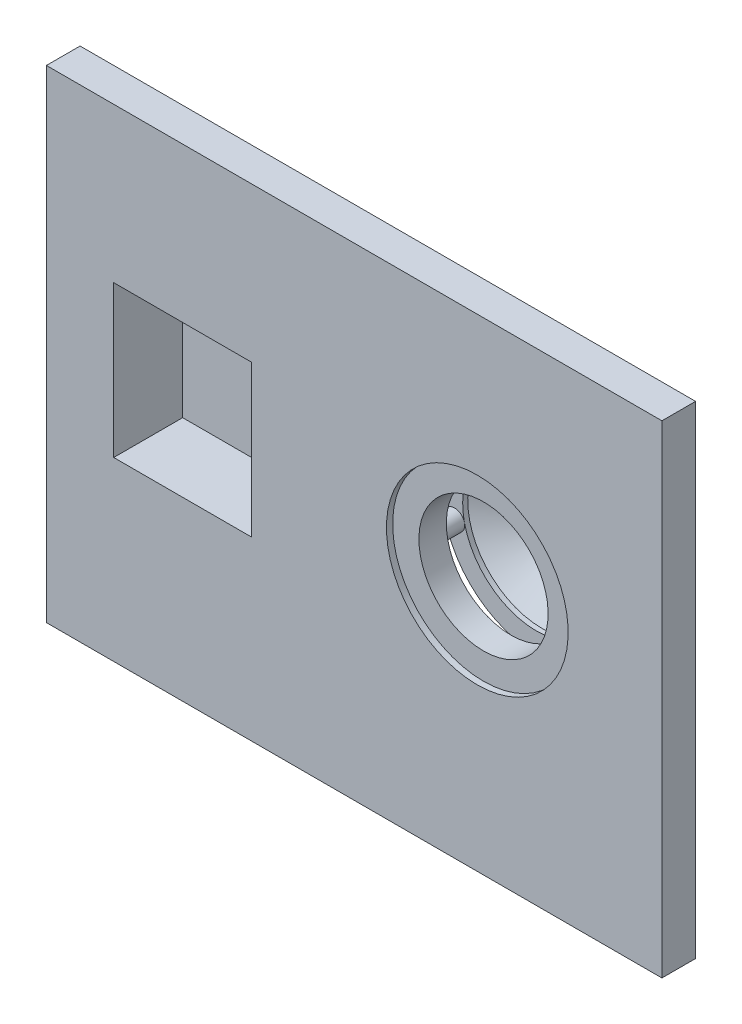
ISO-10303-21;
HEADER;
FILE_DESCRIPTION(('STEP AP214'),'2;1');
FILE_NAME('part.step','',(''),(''),'','','');
FILE_SCHEMA(('AUTOMOTIVE_DESIGN { 1 0 10303 214 1 1 1 1 }'));
ENDSEC;
DATA;
#1=APPLICATION_CONTEXT('core data for automotive mechanical design processes');
#2=APPLICATION_PROTOCOL_DEFINITION('international standard','automotive_design',2000,#1);
#3=PRODUCT_CONTEXT('',#1,'mechanical');
#4=PRODUCT('Part','Part','',(#3));
#5=PRODUCT_RELATED_PRODUCT_CATEGORY('part','',(#4));
#6=PRODUCT_DEFINITION_FORMATION('','',#4);
#7=PRODUCT_DEFINITION_CONTEXT('part definition',#1,'design');
#8=PRODUCT_DEFINITION('design','',#6,#7);
#9=PRODUCT_DEFINITION_SHAPE('','',#8);
#10=(LENGTH_UNIT() NAMED_UNIT(*) SI_UNIT(.MILLI.,.METRE.));
#11=(NAMED_UNIT(*) PLANE_ANGLE_UNIT() SI_UNIT($,.RADIAN.));
#12=(NAMED_UNIT(*) SI_UNIT($,.STERADIAN.) SOLID_ANGLE_UNIT());
#13=UNCERTAINTY_MEASURE_WITH_UNIT(LENGTH_MEASURE(1.E-05),#10,'distance_accuracy_value','');
#14=(GEOMETRIC_REPRESENTATION_CONTEXT(3) GLOBAL_UNCERTAINTY_ASSIGNED_CONTEXT((#13)) GLOBAL_UNIT_ASSIGNED_CONTEXT((#10,
#11,#12)) REPRESENTATION_CONTEXT('',''));
#15=CARTESIAN_POINT('',(0.,0.,0.));
#16=DIRECTION('',(0.,0.,1.));
#17=DIRECTION('',(1.,0.,0.));
#18=AXIS2_PLACEMENT_3D('',#15,#16,#17);
#19=CARTESIAN_POINT('',(17.1944269729057,-5.48634189692662,-9.99999999999988));
#20=DIRECTION('',(0.,0.,-1.));
#21=DIRECTION('',(-0.219453675877068,0.975622921083778,0.));
#22=AXIS2_PLACEMENT_3D('',#19,#20,#21);
#23=CYLINDRICAL_SURFACE('',#22,3.);
#24=CARTESIAN_POINT('',(17.1944269729056,-5.48634189692665,-17.6550000000001));
#25=DIRECTION('',(0.,0.,1.));
#26=DIRECTION('',(-0.975622921083778,-0.219453675877068,0.));
#27=AXIS2_PLACEMENT_3D('',#24,#25,#26);
#28=CIRCLE('',#27,3.);
#29=CARTESIAN_POINT('',(14.2675582096543,-6.14470292455785,-17.655));
#30=VERTEX_POINT('',#29);
#31=CARTESIAN_POINT('',(20.121295736157,-4.82798086929544,-17.6550000000001));
#32=VERTEX_POINT('',#31);
#33=EDGE_CURVE('E666',#30,#32,#28,.F.);
#34=ORIENTED_EDGE('',*,*,#33,.F.);
#35=EDGE_CURVE('E630',#32,#30,#28,.F.);
#36=ORIENTED_EDGE('',*,*,#35,.F.);
#37=EDGE_LOOP('',(#34,#36));
#38=FACE_BOUND('',#37,.T.);
#39=CARTESIAN_POINT('',(17.1944269729057,-5.48634189692662,-9.99999999999988));
#40=DIRECTION('',(0.,0.,1.));
#41=DIRECTION('',(0.219453675877068,-0.975622921083778,0.));
#42=AXIS2_PLACEMENT_3D('',#39,#40,#41);
#43=CIRCLE('',#42,3.);
#44=CARTESIAN_POINT('',(17.8527880005369,-8.41321066017795,-9.99999999999988));
#45=VERTEX_POINT('',#44);
#46=EDGE_CURVE('E668',#45,#45,#43,.T.);
#47=ORIENTED_EDGE('',*,*,#46,.F.);
#48=EDGE_LOOP('',(#47));
#49=FACE_BOUND('',#48,.T.);
#50=ADVANCED_FACE('F39',(#38,#49),#23,.T.);
#51=CARTESIAN_POINT('',(22.0883316375154,15.648639645774,-9.99999999999994));
#52=DIRECTION('',(0.,0.,-1.));
#53=DIRECTION('',(0.625945585830957,0.779866734499389,0.));
#54=AXIS2_PLACEMENT_3D('',#51,#52,#53);
#55=CYLINDRICAL_SURFACE('',#54,3.);
#56=CARTESIAN_POINT('',(22.0883316375154,15.648639645774,-17.6550000000001));
#57=DIRECTION('',(0.,0.,1.));
#58=DIRECTION('',(-0.779866734499389,0.625945585830957,0.));
#59=AXIS2_PLACEMENT_3D('',#56,#57,#58);
#60=CIRCLE('',#59,3.);
#61=CARTESIAN_POINT('',(19.7487314340172,17.5264764032668,-17.6550000000001));
#62=VERTEX_POINT('',#61);
#63=CARTESIAN_POINT('',(24.4279318410135,13.7708028882811,-17.6550000000001));
#64=VERTEX_POINT('',#63);
#65=EDGE_CURVE('E674',#62,#64,#60,.F.);
#66=ORIENTED_EDGE('',*,*,#65,.F.);
#67=EDGE_CURVE('E677',#64,#62,#60,.F.);
#68=ORIENTED_EDGE('',*,*,#67,.F.);
#69=EDGE_LOOP('',(#66,#68));
#70=FACE_BOUND('',#69,.T.);
#71=CARTESIAN_POINT('',(22.0883316375154,15.648639645774,-9.99999999999994));
#72=DIRECTION('',(0.,0.,1.));
#73=DIRECTION('',(-0.625945585830957,-0.779866734499389,0.));
#74=AXIS2_PLACEMENT_3D('',#71,#72,#73);
#75=CIRCLE('',#74,3.);
#76=CARTESIAN_POINT('',(20.2104948800225,13.3090394422758,-9.99999999999993));
#77=VERTEX_POINT('',#76);
#78=EDGE_CURVE('E671',#77,#77,#75,.T.);
#79=ORIENTED_EDGE('',*,*,#78,.F.);
#80=EDGE_LOOP('',(#79));
#81=FACE_BOUND('',#80,.T.);
#82=ADVANCED_FACE('F493',(#70,#81),#55,.T.);
#83=CARTESIAN_POINT('',(63.0487042638432,4.82798086929556,-17.6550000000002));
#84=DIRECTION('',(0.,0.,1.));
#85=DIRECTION('',(-0.975622921083778,-0.219453675877068,0.));
#86=AXIS2_PLACEMENT_3D('',#83,#84,#85);
#87=PLANE('',#86);
#88=CARTESIAN_POINT('',(41.5850000000001,0.,-17.6550000000001));
#89=DIRECTION('',(0.,0.,-1.));
#90=DIRECTION('',(0.975622921083778,0.219453675877068,0.));
#91=AXIS2_PLACEMENT_3D('',#88,#89,#90);
#92=CIRCLE('',#91,22.);
#93=EDGE_CURVE('E11',#32,#64,#92,.T.);
#94=ORIENTED_EDGE('',*,*,#93,.T.);
#95=ORIENTED_EDGE('',*,*,#67,.T.);
#96=CARTESIAN_POINT('',(41.5850000000001,0.,-17.6550000000001));
#97=DIRECTION('',(0.,0.,-1.));
#98=DIRECTION('',(0.975622921083778,0.219453675877068,0.));
#99=AXIS2_PLACEMENT_3D('',#96,#97,#98);
#100=CIRCLE('',#99,28.);
#101=EDGE_CURVE('E640',#30,#62,#100,.T.);
#102=ORIENTED_EDGE('',*,*,#101,.F.);
#103=ORIENTED_EDGE('',*,*,#33,.T.);
#104=EDGE_LOOP('',(#94,#95,#102,#103));
#105=FACE_BOUND('',#104,.T.);
#106=ADVANCED_FACE('F254',(#105),#87,.T.);
#107=CARTESIAN_POINT('',(41.6636252386325,24.9998763611313,-10.));
#108=DIRECTION('',(0.,0.,-1.));
#109=DIRECTION('',(0.999995054445251,-0.00314500954529701,0.));
#110=AXIS2_PLACEMENT_3D('',#107,#108,#109);
#111=CYLINDRICAL_SURFACE('',#110,3.);
#112=CARTESIAN_POINT('',(41.6636252386325,24.9998763611313,-17.6550000000002));
#113=DIRECTION('',(0.,0.,1.));
#114=DIRECTION('',(0.00314500954529701,0.999995054445251,0.));
#115=AXIS2_PLACEMENT_3D('',#112,#113,#114);
#116=CIRCLE('',#115,3.);
#117=CARTESIAN_POINT('',(41.6730602672684,27.9998615244671,-17.6550000000002));
#118=VERTEX_POINT('',#117);
#119=CARTESIAN_POINT('',(41.6541902099966,21.9998911977956,-17.6550000000002));
#120=VERTEX_POINT('',#119);
#121=EDGE_CURVE('E681',#118,#120,#116,.F.);
#122=ORIENTED_EDGE('',*,*,#121,.F.);
#123=EDGE_CURVE('E684',#120,#118,#116,.F.);
#124=ORIENTED_EDGE('',*,*,#123,.F.);
#125=EDGE_LOOP('',(#122,#124));
#126=FACE_BOUND('',#125,.T.);
#127=CARTESIAN_POINT('',(41.6636252386325,24.9998763611313,-10.));
#128=DIRECTION('',(0.,0.,1.));
#129=DIRECTION('',(-0.999995054445251,0.00314500954529701,0.));
#130=AXIS2_PLACEMENT_3D('',#127,#128,#129);
#131=CIRCLE('',#130,3.);
#132=CARTESIAN_POINT('',(38.6636400752968,25.0093113897672,-10.));
#133=VERTEX_POINT('',#132);
#134=EDGE_CURVE('E678',#133,#133,#131,.T.);
#135=ORIENTED_EDGE('',*,*,#134,.F.);
#136=EDGE_LOOP('',(#135));
#137=FACE_BOUND('',#136,.T.);
#138=ADVANCED_FACE('F524',(#126,#137),#111,.T.);
#139=EDGE_CURVE('E49',#64,#120,#92,.T.);
#140=ORIENTED_EDGE('',*,*,#139,.T.);
#141=ORIENTED_EDGE('',*,*,#123,.T.);
#142=EDGE_CURVE('E647',#62,#118,#100,.T.);
#143=ORIENTED_EDGE('',*,*,#142,.F.);
#144=ORIENTED_EDGE('',*,*,#65,.T.);
#145=EDGE_LOOP('',(#140,#141,#143,#144));
#146=FACE_BOUND('',#145,.T.);
#147=ADVANCED_FACE('F512',(#146),#87,.T.);
#148=CARTESIAN_POINT('',(61.1797124313969,15.5256962720152,-10.));
#149=DIRECTION('',(0.,0.,-1.));
#150=DIRECTION('',(0.621027850880606,-0.783788497255871,0.));
#151=AXIS2_PLACEMENT_3D('',#148,#149,#150);
#152=CYLINDRICAL_SURFACE('',#151,3.);
#153=CARTESIAN_POINT('',(61.1797124313969,15.5256962720152,-17.6550000000002));
#154=DIRECTION('',(0.,0.,1.));
#155=DIRECTION('',(0.783788497255871,0.621027850880606,0.));
#156=AXIS2_PLACEMENT_3D('',#153,#154,#155);
#157=CIRCLE('',#156,3.);
#158=CARTESIAN_POINT('',(63.5310779231645,17.388779824657,-17.6550000000002));
#159=VERTEX_POINT('',#158);
#160=CARTESIAN_POINT('',(58.8283469396292,13.6626127193734,-17.6550000000002));
#161=VERTEX_POINT('',#160);
#162=EDGE_CURVE('E688',#159,#161,#157,.F.);
#163=ORIENTED_EDGE('',*,*,#162,.F.);
#164=EDGE_CURVE('E690',#161,#159,#157,.F.);
#165=ORIENTED_EDGE('',*,*,#164,.F.);
#166=EDGE_LOOP('',(#163,#165));
#167=FACE_BOUND('',#166,.T.);
#168=CARTESIAN_POINT('',(61.1797124313969,15.5256962720152,-10.));
#169=DIRECTION('',(0.,0.,1.));
#170=DIRECTION('',(-0.621027850880606,0.783788497255871,0.));
#171=AXIS2_PLACEMENT_3D('',#168,#169,#170);
#172=CIRCLE('',#171,3.);
#173=CARTESIAN_POINT('',(59.316628878755,17.8770617637828,-10.));
#174=VERTEX_POINT('',#173);
#175=EDGE_CURVE('E685',#174,#174,#172,.T.);
#176=ORIENTED_EDGE('',*,*,#175,.F.);
#177=EDGE_LOOP('',(#176));
#178=FACE_BOUND('',#177,.T.);
#179=ADVANCED_FACE('F552',(#167,#178),#152,.T.);
#180=EDGE_CURVE('E699',#120,#161,#92,.T.);
#181=ORIENTED_EDGE('',*,*,#180,.T.);
#182=ORIENTED_EDGE('',*,*,#164,.T.);
#183=EDGE_CURVE('E645',#118,#159,#100,.T.);
#184=ORIENTED_EDGE('',*,*,#183,.F.);
#185=ORIENTED_EDGE('',*,*,#121,.T.);
#186=EDGE_LOOP('',(#181,#182,#184,#185));
#187=FACE_BOUND('',#186,.T.);
#188=ADVANCED_FACE('F540',(#187),#87,.T.);
#189=CARTESIAN_POINT('',(65.9405815040285,-5.63964977641604,-10.));
#190=DIRECTION('',(0.,0.,-1.));
#191=DIRECTION('',(-0.225585991056645,-0.974223260161135,0.));
#192=AXIS2_PLACEMENT_3D('',#189,#190,#191);
#193=CYLINDRICAL_SURFACE('',#192,3.);
#194=CARTESIAN_POINT('',(65.9405815040285,-5.63964977641606,-17.6550000000002));
#195=DIRECTION('',(0.,0.,1.));
#196=DIRECTION('',(0.974223260161135,-0.225585991056645,0.));
#197=AXIS2_PLACEMENT_3D('',#194,#195,#196);
#198=CIRCLE('',#197,3.);
#199=CARTESIAN_POINT('',(68.8632512845119,-6.316407749586,-17.6550000000002));
#200=VERTEX_POINT('',#199);
#201=CARTESIAN_POINT('',(63.0179117235451,-4.96289180324613,-17.6550000000002));
#202=VERTEX_POINT('',#201);
#203=EDGE_CURVE('E626',#200,#202,#198,.F.);
#204=ORIENTED_EDGE('',*,*,#203,.F.);
#205=EDGE_CURVE('E58',#202,#200,#198,.F.);
#206=ORIENTED_EDGE('',*,*,#205,.F.);
#207=EDGE_LOOP('',(#204,#206));
#208=FACE_BOUND('',#207,.T.);
#209=CARTESIAN_POINT('',(65.9405815040285,-5.63964977641604,-10.));
#210=DIRECTION('',(0.,0.,1.));
#211=DIRECTION('',(0.225585991056645,0.974223260161135,0.));
#212=AXIS2_PLACEMENT_3D('',#209,#210,#211);
#213=CIRCLE('',#212,3.);
#214=CARTESIAN_POINT('',(66.6173394771984,-2.71697999593264,-10.));
#215=VERTEX_POINT('',#214);
#216=EDGE_CURVE('E691',#215,#215,#213,.T.);
#217=ORIENTED_EDGE('',*,*,#216,.F.);
#218=EDGE_LOOP('',(#217));
#219=FACE_BOUND('',#218,.T.);
#220=ADVANCED_FACE('F327',(#208,#219),#193,.T.);
#221=EDGE_CURVE('E696',#161,#202,#92,.T.);
#222=ORIENTED_EDGE('',*,*,#221,.T.);
#223=ORIENTED_EDGE('',*,*,#205,.T.);
#224=EDGE_CURVE('E637',#159,#200,#100,.T.);
#225=ORIENTED_EDGE('',*,*,#224,.F.);
#226=ORIENTED_EDGE('',*,*,#162,.T.);
#227=EDGE_LOOP('',(#222,#223,#225,#226));
#228=FACE_BOUND('',#227,.T.);
#229=ADVANCED_FACE('F526',(#228),#87,.T.);
#230=EDGE_CURVE('E623',#200,#30,#100,.T.);
#231=ORIENTED_EDGE('',*,*,#230,.F.);
#232=ORIENTED_EDGE('',*,*,#203,.T.);
#233=EDGE_CURVE('E51',#202,#32,#92,.T.);
#234=ORIENTED_EDGE('',*,*,#233,.T.);
#235=ORIENTED_EDGE('',*,*,#35,.T.);
#236=EDGE_LOOP('',(#231,#232,#234,#235));
#237=FACE_BOUND('',#236,.T.);
#238=ADVANCED_FACE('F248',(#237),#87,.T.);
#239=CARTESIAN_POINT('',(41.5850000000001,0.,-19.1550000000002));
#240=DIRECTION('',(0.,0.,1.));
#241=DIRECTION('',(-0.975622921083778,-0.219453675877068,0.));
#242=AXIS2_PLACEMENT_3D('',#239,#240,#241);
#243=CONICAL_SURFACE('',#242,22.,1.0372252204965);
#244=CARTESIAN_POINT('',(41.585,0.,-31.1550000000001));
#245=DIRECTION('',(0.,0.,-1.));
#246=DIRECTION('',(0.975622921083778,0.219453675877068,0.));
#247=AXIS2_PLACEMENT_3D('',#244,#245,#246);
#248=CIRCLE('',#247,1.68594999999996);
#249=CARTESIAN_POINT('',(39.9401485361989,-0.369987924844903,-31.1550000000001));
#250=VERTEX_POINT('',#249);
#251=EDGE_CURVE('E661',#250,#250,#248,.T.);
#252=CARTESIAN_POINT('',(41.5850000000001,0.,-19.1550000000002));
#253=DIRECTION('',(0.,0.,-1.));
#254=DIRECTION('',(0.975622921083778,0.219453675877068,0.));
#255=AXIS2_PLACEMENT_3D('',#252,#253,#254);
#256=CIRCLE('',#255,22.);
#257=CARTESIAN_POINT('',(20.121295736157,-4.82798086929544,-19.1550000000001));
#258=VERTEX_POINT('',#257);
#259=EDGE_CURVE('E664',#258,#258,#256,.T.);
#260=CARTESIAN_POINT('',(39.9401485361989,-0.369987924844903,-31.1550000000001));
#261=CARTESIAN_POINT('',(39.7337021528651,-0.416425351349596,-31.0300000000001));
#262=CARTESIAN_POINT('',(39.5272557695313,-0.462862777854289,-30.9050000000001));
#263=CARTESIAN_POINT('',(39.1143630028638,-0.555737630863676,-30.6550000000001));
#264=CARTESIAN_POINT('',(38.90791661953,-0.602175057368369,-30.5300000000001));
#265=CARTESIAN_POINT('',(38.4950238528625,-0.695049910377755,-30.2800000000001));
#266=CARTESIAN_POINT('',(38.2885774695287,-0.741487336882448,-30.1550000000001));
#267=CARTESIAN_POINT('',(37.8756847028612,-0.834362189891834,-29.9050000000001));
#268=CARTESIAN_POINT('',(37.6692383195274,-0.880799616396528,-29.7800000000001));
#269=CARTESIAN_POINT('',(37.2563455528599,-0.973674469405914,-29.5300000000001));
#270=CARTESIAN_POINT('',(37.0498991695261,-1.02011189591061,-29.4050000000001));
#271=CARTESIAN_POINT('',(36.6370064028586,-1.11298674891999,-29.1550000000001));
#272=CARTESIAN_POINT('',(36.4305600195248,-1.15942417542469,-29.0300000000001));
#273=CARTESIAN_POINT('',(36.0176672528573,-1.25229902843407,-28.7800000000001));
#274=CARTESIAN_POINT('',(35.8112208695235,-1.29873645493877,-28.6550000000001));
#275=CARTESIAN_POINT('',(35.398328102856,-1.39161130794815,-28.4050000000001));
#276=CARTESIAN_POINT('',(35.1918817195222,-1.43804873445284,-28.2800000000001));
#277=CARTESIAN_POINT('',(34.7789889528546,-1.53092358746223,-28.0300000000001));
#278=CARTESIAN_POINT('',(34.5725425695209,-1.57736101396692,-27.9050000000001));
#279=CARTESIAN_POINT('',(34.1596498028533,-1.67023586697631,-27.6550000000001));
#280=CARTESIAN_POINT('',(33.9532034195196,-1.716673293481,-27.5300000000001));
#281=CARTESIAN_POINT('',(33.540310652852,-1.80954814649039,-27.2800000000001));
#282=CARTESIAN_POINT('',(33.3338642695183,-1.85598557299508,-27.1550000000001));
#283=CARTESIAN_POINT('',(32.9209715028507,-1.94886042600447,-26.9050000000001));
#284=CARTESIAN_POINT('',(32.7145251195169,-1.99529785250916,-26.7800000000001));
#285=CARTESIAN_POINT('',(32.3016323528494,-2.08817270551855,-26.5300000000001));
#286=CARTESIAN_POINT('',(32.0951859695156,-2.13461013202324,-26.4050000000001));
#287=CARTESIAN_POINT('',(31.6822932028481,-2.22748498503263,-26.1550000000001));
#288=CARTESIAN_POINT('',(31.4758468195143,-2.27392241153732,-26.0300000000001));
#289=CARTESIAN_POINT('',(31.0629540528468,-2.36679726454671,-25.7800000000001));
#290=CARTESIAN_POINT('',(30.856507669513,-2.4132346910514,-25.6550000000001));
#291=CARTESIAN_POINT('',(30.4436149028455,-2.50610954406079,-25.4050000000001));
#292=CARTESIAN_POINT('',(30.2371685195117,-2.55254697056548,-25.2800000000001));
#293=CARTESIAN_POINT('',(29.8242757528442,-2.64542182357487,-25.0300000000001));
#294=CARTESIAN_POINT('',(29.6178293695104,-2.69185925007956,-24.9050000000001));
#295=CARTESIAN_POINT('',(29.2049366028428,-2.78473410308895,-24.6550000000001));
#296=CARTESIAN_POINT('',(28.9984902195091,-2.83117152959364,-24.5300000000001));
#297=CARTESIAN_POINT('',(28.5855974528415,-2.92404638260303,-24.2800000000001));
#298=CARTESIAN_POINT('',(28.3791510695078,-2.97048380910772,-24.1550000000001));
#299=CARTESIAN_POINT('',(27.9662583028402,-3.0633586621171,-23.9050000000001));
#300=CARTESIAN_POINT('',(27.7598119195065,-3.1097960886218,-23.7800000000001));
#301=CARTESIAN_POINT('',(27.3469191528389,-3.20267094163118,-23.5300000000001));
#302=CARTESIAN_POINT('',(27.1404727695051,-3.24910836813588,-23.4050000000001));
#303=CARTESIAN_POINT('',(26.7275800028376,-3.34198322114526,-23.1550000000001));
#304=CARTESIAN_POINT('',(26.5211336195038,-3.38842064764996,-23.0300000000001));
#305=CARTESIAN_POINT('',(26.1082408528363,-3.48129550065934,-22.7800000000001));
#306=CARTESIAN_POINT('',(25.9017944695025,-3.52773292716404,-22.6550000000001));
#307=CARTESIAN_POINT('',(25.488901702835,-3.62060778017342,-22.4050000000001));
#308=CARTESIAN_POINT('',(25.2824553195012,-3.66704520667812,-22.2800000000001));
#309=CARTESIAN_POINT('',(24.8695625528337,-3.7599200596875,-22.0300000000001));
#310=CARTESIAN_POINT('',(24.6631161694999,-3.80635748619219,-21.9050000000001));
#311=CARTESIAN_POINT('',(24.2502234028324,-3.89923233920158,-21.6550000000001));
#312=CARTESIAN_POINT('',(24.0437770194986,-3.94566976570627,-21.5300000000001));
#313=CARTESIAN_POINT('',(23.6308842528311,-4.03854461871566,-21.2800000000001));
#314=CARTESIAN_POINT('',(23.4244378694973,-4.08498204522035,-21.1550000000001));
#315=CARTESIAN_POINT('',(23.0115451028298,-4.17785689822974,-20.9050000000001));
#316=CARTESIAN_POINT('',(22.805098719496,-4.22429432473443,-20.7800000000001));
#317=CARTESIAN_POINT('',(22.3922059528284,-4.31716917774382,-20.5300000000001));
#318=CARTESIAN_POINT('',(22.1857595694947,-4.36360660424851,-20.4050000000001));
#319=CARTESIAN_POINT('',(21.7728668028271,-4.4564814572579,-20.1550000000001));
#320=CARTESIAN_POINT('',(21.5664204194934,-4.50291888376259,-20.0300000000001));
#321=CARTESIAN_POINT('',(21.1535276528258,-4.59579373677198,-19.7800000000001));
#322=CARTESIAN_POINT('',(20.947081269492,-4.64223116327667,-19.6550000000001));
#323=CARTESIAN_POINT('',(20.5341885028245,-4.73510601628606,-19.4050000000001));
#324=CARTESIAN_POINT('',(20.3277421194907,-4.78154344279075,-19.2800000000001));
#325=CARTESIAN_POINT('',(20.121295736157,-4.82798086929544,-19.1550000000001));
#326=B_SPLINE_CURVE_WITH_KNOTS('',3,(#260,#261,#262,#263,#264,#265,#266,#267,#268,#269,#270,
#271,#272,#273,#274,#275,#276,#277,#278,#279,#280,#281,#282,#283,#284,#285,#286,#287,#288,#289,
#290,#291,#292,#293,#294,#295,#296,#297,#298,#299,#300,#301,#302,#303,#304,#305,#306,#307,#308,
#309,#310,#311,#312,#313,#314,#315,#316,#317,#318,#319,#320,#321,#322,#323,#324,#325),
.UNSPECIFIED.,.F.,.F.,(4,2,2,2,2,2,2,2,2,2,2,2,2,2,2,2,2,2,2,2,2,2,2,2,2,2,2,2,2,2,2,2,4),(0.,
0.737301765865074,1.47460353173014,2.21190529759522,2.94920706346029,3.68650882932536,
4.42381059519043,5.1611123610555,5.89841412692057,6.63571589278564,7.37301765865072,
8.11031942451579,8.84762119038086,9.58492295624594,10.322224722111,11.0595264879761,
11.7968282538412,12.5341300197062,13.2714317855713,14.0087335514364,14.7460353173014,
15.4833370831665,16.2206388490316,16.9579406148967,17.6952423807617,18.4325441466268,
19.1698459124919,19.9071476783569,20.644449444222,21.3817512100871,22.1190529759522,
22.8563547418172,23.5936565076823),.UNSPECIFIED.);
#327=EDGE_CURVE('BSEAM238',#250,#258,#326,.T.);
#328=ORIENTED_EDGE('',*,*,#251,.T.);
#329=ORIENTED_EDGE('',*,*,#259,.F.);
#330=ORIENTED_EDGE('',*,*,#327,.T.);
#331=ORIENTED_EDGE('',*,*,#327,.F.);
#332=EDGE_LOOP('',(#328,#330,#329,#331));
#333=FACE_BOUND('',#332,.T.);
#334=ADVANCED_FACE('F238',(#333),#243,.F.);
#335=CARTESIAN_POINT('',(41.5849999999985,-1.18526140790754E-12,-601.601756225542));
#336=DIRECTION('',(0.,0.,-1.));
#337=DIRECTION('',(0.975622921083778,0.219453675877068,0.));
#338=AXIS2_PLACEMENT_3D('',#335,#336,#337);
#339=CYLINDRICAL_SURFACE('',#338,22.);
#340=ORIENTED_EDGE('',*,*,#259,.T.);
#341=EDGE_LOOP('',(#340));
#342=FACE_BOUND('',#341,.T.);
#343=ORIENTED_EDGE('',*,*,#93,.F.);
#344=ORIENTED_EDGE('',*,*,#233,.F.);
#345=ORIENTED_EDGE('',*,*,#221,.F.);
#346=ORIENTED_EDGE('',*,*,#180,.F.);
#347=ORIENTED_EDGE('',*,*,#139,.F.);
#348=EDGE_LOOP('',(#343,#344,#345,#346,#347));
#349=FACE_BOUND('',#348,.T.);
#350=ADVANCED_FACE('F235',(#342,#349),#339,.F.);
#351=CARTESIAN_POINT('',(44.682602774441,0.696765420909712,-31.1550000000001));
#352=DIRECTION('',(0.,0.,-1.));
#353=DIRECTION('',(0.975622921083778,0.219453675877068,0.));
#354=AXIS2_PLACEMENT_3D('',#351,#352,#353);
#355=PLANE('',#354);
#356=CARTESIAN_POINT('',(41.585,0.,-31.1550000000001));
#357=DIRECTION('',(0.,0.,-1.));
#358=DIRECTION('',(0.975622921083778,0.219453675877068,0.));
#359=AXIS2_PLACEMENT_3D('',#356,#357,#358);
#360=CIRCLE('',#359,3.17499999999996);
#361=CARTESIAN_POINT('',(38.4873972255591,-0.696765420909652,-31.155));
#362=VERTEX_POINT('',#361);
#363=EDGE_CURVE('E658',#362,#362,#360,.T.);
#364=ORIENTED_EDGE('',*,*,#363,.T.);
#365=EDGE_LOOP('',(#364));
#366=FACE_BOUND('',#365,.T.);
#367=ORIENTED_EDGE('',*,*,#251,.F.);
#368=EDGE_LOOP('',(#367));
#369=FACE_BOUND('',#368,.T.);
#370=ADVANCED_FACE('F237',(#366,#369),#355,.T.);
#371=CARTESIAN_POINT('',(41.585,0.,-31.1550000000001));
#372=DIRECTION('',(0.,0.,1.));
#373=DIRECTION('',(-0.975622921083778,-0.219453675877068,0.));
#374=AXIS2_PLACEMENT_3D('',#371,#372,#373);
#375=CONICAL_SURFACE('',#374,3.17499999999996,1.12052991420768);
#376=CARTESIAN_POINT('',(41.5850000000001,0.,-19.1550000000002));
#377=DIRECTION('',(0.,0.,-1.));
#378=DIRECTION('',(0.975622921083778,0.219453675877068,0.));
#379=AXIS2_PLACEMENT_3D('',#376,#377,#378);
#380=CIRCLE('',#379,28.);
#381=CARTESIAN_POINT('',(14.2675582096543,-6.14470292455785,-19.1550000000001));
#382=VERTEX_POINT('',#381);
#383=EDGE_CURVE('E638',#382,#382,#380,.T.);
#384=CARTESIAN_POINT('',(14.2675582096543,-6.14470292455785,-19.1550000000001));
#385=CARTESIAN_POINT('',(14.5198481994033,-6.08795357556152,-19.2800000000001));
#386=CARTESIAN_POINT('',(14.7721381891523,-6.03120422656518,-19.4050000000001));
#387=CARTESIAN_POINT('',(15.2767181686503,-5.91770552857251,-19.6550000000001));
#388=CARTESIAN_POINT('',(15.5290081583993,-5.86095617957617,-19.7800000000001));
#389=CARTESIAN_POINT('',(16.0335881378974,-5.7474574815835,-20.0300000000001));
#390=CARTESIAN_POINT('',(16.2858781276464,-5.69070813258717,-20.1550000000001));
#391=CARTESIAN_POINT('',(16.7904581071444,-5.5772094345945,-20.4050000000001));
#392=CARTESIAN_POINT('',(17.0427480968934,-5.52046008559816,-20.5300000000001));
#393=CARTESIAN_POINT('',(17.5473280763914,-5.40696138760549,-20.7800000000001));
#394=CARTESIAN_POINT('',(17.7996180661404,-5.35021203860915,-20.9050000000001));
#395=CARTESIAN_POINT('',(18.3041980456384,-5.23671334061648,-21.1550000000001));
#396=CARTESIAN_POINT('',(18.5564880353874,-5.17996399162015,-21.2800000000001));
#397=CARTESIAN_POINT('',(19.0610680148855,-5.06646529362748,-21.5300000000001));
#398=CARTESIAN_POINT('',(19.3133580046345,-5.00971594463114,-21.6550000000001));
#399=CARTESIAN_POINT('',(19.8179379841325,-4.89621724663847,-21.9050000000001));
#400=CARTESIAN_POINT('',(20.0702279738815,-4.83946789764214,-22.0300000000001));
#401=CARTESIAN_POINT('',(20.5748079533795,-4.72596919964947,-22.2800000000001));
#402=CARTESIAN_POINT('',(20.8270979431285,-4.66921985065313,-22.4050000000001));
#403=CARTESIAN_POINT('',(21.3316779226265,-4.55572115266046,-22.6550000000001));
#404=CARTESIAN_POINT('',(21.5839679123755,-4.49897180366412,-22.7800000000001));
#405=CARTESIAN_POINT('',(22.0885478918736,-4.38547310567145,-23.0300000000001));
#406=CARTESIAN_POINT('',(22.3408378816226,-4.32872375667512,-23.1550000000001));
#407=CARTESIAN_POINT('',(22.8454178611206,-4.21522505868245,-23.4050000000001));
#408=CARTESIAN_POINT('',(23.0977078508696,-4.15847570968611,-23.5300000000001));
#409=CARTESIAN_POINT('',(23.6022878303676,-4.04497701169344,-23.7800000000001));
#410=CARTESIAN_POINT('',(23.8545778201166,-3.9882276626971,-23.9050000000001));
#411=CARTESIAN_POINT('',(24.3591577996146,-3.87472896470443,-24.1550000000001));
#412=CARTESIAN_POINT('',(24.6114477893636,-3.8179796157081,-24.2800000000001));
#413=CARTESIAN_POINT('',(25.1160277688617,-3.70448091771543,-24.5300000000001));
#414=CARTESIAN_POINT('',(25.3683177586107,-3.64773156871909,-24.6550000000001));
#415=CARTESIAN_POINT('',(25.8728977381087,-3.53423287072642,-24.9050000000001));
#416=CARTESIAN_POINT('',(26.1251877278577,-3.47748352173009,-25.0300000000001));
#417=CARTESIAN_POINT('',(26.6297677073557,-3.36398482373742,-25.2800000000001));
#418=CARTESIAN_POINT('',(26.8820576971047,-3.30723547474108,-25.4050000000001));
#419=CARTESIAN_POINT('',(27.3866376766027,-3.19373677674841,-25.6550000000001));
#420=CARTESIAN_POINT('',(27.6389276663517,-3.13698742775207,-25.7800000000001));
#421=CARTESIAN_POINT('',(28.1435076458498,-3.0234887297594,-26.0300000000001));
#422=CARTESIAN_POINT('',(28.3957976355988,-2.96673938076307,-26.1550000000001));
#423=CARTESIAN_POINT('',(28.9003776150968,-2.8532406827704,-26.4050000000001));
#424=CARTESIAN_POINT('',(29.1526676048458,-2.79649133377406,-26.5300000000001));
#425=CARTESIAN_POINT('',(29.6572475843438,-2.68299263578139,-26.7800000000001));
#426=CARTESIAN_POINT('',(29.9095375740928,-2.62624328678506,-26.9050000000001));
#427=CARTESIAN_POINT('',(30.4141175535908,-2.51274458879239,-27.1550000000001));
#428=CARTESIAN_POINT('',(30.6664075433398,-2.45599523979605,-27.2800000000001));
#429=CARTESIAN_POINT('',(31.1709875228379,-2.34249654180338,-27.5300000000001));
#430=CARTESIAN_POINT('',(31.4232775125869,-2.28574719280704,-27.6550000000001));
#431=CARTESIAN_POINT('',(31.9278574920849,-2.17224849481437,-27.9050000000001));
#432=CARTESIAN_POINT('',(32.1801474818339,-2.11549914581804,-28.0300000000001));
#433=CARTESIAN_POINT('',(32.6847274613319,-2.00200044782537,-28.2800000000001));
#434=CARTESIAN_POINT('',(32.9370174510809,-1.94525109882903,-28.4050000000001));
#435=CARTESIAN_POINT('',(33.4415974305789,-1.83175240083636,-28.6550000000001));
#436=CARTESIAN_POINT('',(33.6938874203279,-1.77500305184002,-28.7800000000001));
#437=CARTESIAN_POINT('',(34.198467399826,-1.66150435384735,-29.0300000000001));
#438=CARTESIAN_POINT('',(34.450757389575,-1.60475500485102,-29.1550000000001));
#439=CARTESIAN_POINT('',(34.955337369073,-1.49125630685835,-29.4050000000001));
#440=CARTESIAN_POINT('',(35.207627358822,-1.43450695786201,-29.5300000000001));
#441=CARTESIAN_POINT('',(35.71220733832,-1.32100825986934,-29.7800000000001));
#442=CARTESIAN_POINT('',(35.964497328069,-1.26425891087301,-29.9050000000001));
#443=CARTESIAN_POINT('',(36.469077307567,-1.15076021288033,-30.1550000000001));
#444=CARTESIAN_POINT('',(36.721367297316,-1.094010863884,-30.2800000000001));
#445=CARTESIAN_POINT('',(37.225947276814,-0.980512165891329,-30.5300000000001));
#446=CARTESIAN_POINT('',(37.4782372665631,-0.923762816894993,-30.6550000000001));
#447=CARTESIAN_POINT('',(37.9828172460611,-0.810264118902322,-30.9050000000001));
#448=CARTESIAN_POINT('',(38.2351072358101,-0.753514769905987,-31.0300000000001));
#449=CARTESIAN_POINT('',(38.4873972255591,-0.696765420909652,-31.1550000000001));
#450=B_SPLINE_CURVE_WITH_KNOTS('',3,(#384,#385,#386,#387,#388,#389,#390,#391,#392,#393,#394,
#395,#396,#397,#398,#399,#400,#401,#402,#403,#404,#405,#406,#407,#408,#409,#410,#411,#412,#413,
#414,#415,#416,#417,#418,#419,#420,#421,#422,#423,#424,#425,#426,#427,#428,#429,#430,#431,#432,
#433,#434,#435,#436,#437,#438,#439,#440,#441,#442,#443,#444,#445,#446,#447,#448,#449),
.UNSPECIFIED.,.F.,.F.,(4,2,2,2,2,2,2,2,2,2,2,2,2,2,2,2,2,2,2,2,2,2,2,2,2,2,2,2,2,2,2,2,4),(0.,
0.86166208449227,1.72332416898454,2.58498625347681,3.44664833796908,4.30831042246135,
5.16997250695361,6.03163459144588,6.89329667593815,7.75495876043042,8.61662084492269,
9.47828292941496,10.3399450139072,11.2016070983995,12.0632691828918,12.924931267384,
13.7865933518763,14.6482554363686,15.5099175208608,16.3715796053531,17.2332416898454,
18.0949037743377,18.9565658588299,19.8182279433222,20.6798900278145,21.5415521123067,
22.403214196799,23.2648762812913,24.1265383657835,24.9882004502758,25.8498625347681,
26.7115246192604,27.5731867037526),.UNSPECIFIED.);
#451=EDGE_CURVE('BSEAM245',#382,#362,#450,.T.);
#452=ORIENTED_EDGE('',*,*,#383,.T.);
#453=ORIENTED_EDGE('',*,*,#363,.F.);
#454=ORIENTED_EDGE('',*,*,#451,.T.);
#455=ORIENTED_EDGE('',*,*,#451,.F.);
#456=EDGE_LOOP('',(#452,#454,#453,#455));
#457=FACE_BOUND('',#456,.T.);
#458=ADVANCED_FACE('F245',(#457),#375,.T.);
#459=CARTESIAN_POINT('',(41.5849999999985,-1.18526140790754E-12,-601.601756225542));
#460=DIRECTION('',(0.,0.,-1.));
#461=DIRECTION('',(0.975622921083778,0.219453675877068,0.));
#462=AXIS2_PLACEMENT_3D('',#459,#460,#461);
#463=CYLINDRICAL_SURFACE('',#462,28.);
#464=ORIENTED_EDGE('',*,*,#383,.F.);
#465=EDGE_LOOP('',(#464));
#466=FACE_BOUND('',#465,.T.);
#467=ORIENTED_EDGE('',*,*,#101,.T.);
#468=ORIENTED_EDGE('',*,*,#142,.T.);
#469=ORIENTED_EDGE('',*,*,#183,.T.);
#470=ORIENTED_EDGE('',*,*,#224,.T.);
#471=ORIENTED_EDGE('',*,*,#230,.T.);
#472=EDGE_LOOP('',(#467,#468,#469,#470,#471));
#473=FACE_BOUND('',#472,.T.);
#474=ADVANCED_FACE('F232',(#466,#473),#463,.T.);
#475=CARTESIAN_POINT('',(-45.9527074928854,0.,-20.49));
#476=DIRECTION('',(0.,0.,1.));
#477=DIRECTION('',(0.,-1.,0.));
#478=AXIS2_PLACEMENT_3D('',#475,#476,#477);
#479=PLANE('',#478);
#480=DIRECTION('',(0.,1.,0.));
#481=VECTOR('',#480,1.);
#482=CARTESIAN_POINT('',(-25.4527074928853,22.5,-20.49));
#483=LINE('',#482,#481);
#484=CARTESIAN_POINT('',(-25.4527074928853,-22.5,-20.49));
#485=VERTEX_POINT('',#484);
#486=CARTESIAN_POINT('',(-25.4527074928853,22.5,-20.49));
#487=VERTEX_POINT('',#486);
#488=EDGE_CURVE('E651',#485,#487,#483,.T.);
#489=ORIENTED_EDGE('',*,*,#488,.T.);
#490=DIRECTION('',(-1.,0.,0.));
#491=VECTOR('',#490,1.);
#492=CARTESIAN_POINT('',(-66.4527074928853,22.5,-20.49));
#493=LINE('',#492,#491);
#494=CARTESIAN_POINT('',(-66.4527074928853,22.5,-20.49));
#495=VERTEX_POINT('',#494);
#496=EDGE_CURVE('E654',#487,#495,#493,.T.);
#497=ORIENTED_EDGE('',*,*,#496,.T.);
#498=DIRECTION('',(0.,-1.,0.));
#499=VECTOR('',#498,1.);
#500=CARTESIAN_POINT('',(-66.4527074928853,22.5,-20.49));
#501=LINE('',#500,#499);
#502=CARTESIAN_POINT('',(-66.4527074928853,-22.5,-20.49));
#503=VERTEX_POINT('',#502);
#504=EDGE_CURVE('E214',#495,#503,#501,.T.);
#505=ORIENTED_EDGE('',*,*,#504,.T.);
#506=DIRECTION('',(1.,0.,0.));
#507=VECTOR('',#506,1.);
#508=CARTESIAN_POINT('',(-66.4527074928853,-22.5,-20.49));
#509=LINE('',#508,#507);
#510=EDGE_CURVE('E270',#503,#485,#509,.T.);
#511=ORIENTED_EDGE('',*,*,#510,.T.);
#512=EDGE_LOOP('',(#489,#497,#505,#511));
#513=FACE_BOUND('',#512,.T.);
#514=ADVANCED_FACE('F221',(#513),#479,.T.);
#515=CARTESIAN_POINT('',(-25.4527074928853,22.5,-20.49));
#516=DIRECTION('',(1.,0.,0.));
#517=DIRECTION('',(0.,1.,0.));
#518=AXIS2_PLACEMENT_3D('',#515,#516,#517);
#519=PLANE('',#518);
#520=DIRECTION('',(0.,0.,1.));
#521=VECTOR('',#520,1.);
#522=CARTESIAN_POINT('',(-25.4527074928853,-22.5,-20.49));
#523=LINE('',#522,#521);
#524=CARTESIAN_POINT('',(-25.4527074928853,-22.5,0.));
#525=VERTEX_POINT('',#524);
#526=EDGE_CURVE('E271',#485,#525,#523,.T.);
#527=ORIENTED_EDGE('',*,*,#526,.T.);
#528=DIRECTION('',(0.,-1.,0.));
#529=VECTOR('',#528,1.);
#530=CARTESIAN_POINT('',(-25.4527074928853,0.,0.));
#531=LINE('',#530,#529);
#532=CARTESIAN_POINT('',(-25.4527074928853,22.5,0.));
#533=VERTEX_POINT('',#532);
#534=EDGE_CURVE('E187',#533,#525,#531,.T.);
#535=ORIENTED_EDGE('',*,*,#534,.F.);
#536=DIRECTION('',(0.,0.,1.));
#537=VECTOR('',#536,1.);
#538=CARTESIAN_POINT('',(-25.4527074928853,22.5,-20.49));
#539=LINE('',#538,#537);
#540=EDGE_CURVE('E136',#487,#533,#539,.T.);
#541=ORIENTED_EDGE('',*,*,#540,.F.);
#542=ORIENTED_EDGE('',*,*,#488,.F.);
#543=EDGE_LOOP('',(#527,#535,#541,#542));
#544=FACE_BOUND('',#543,.T.);
#545=ADVANCED_FACE('F219',(#544),#519,.F.);
#546=CARTESIAN_POINT('',(-66.4527074928853,22.5,-20.49));
#547=DIRECTION('',(0.,1.,0.));
#548=DIRECTION('',(-1.,0.,0.));
#549=AXIS2_PLACEMENT_3D('',#546,#547,#548);
#550=PLANE('',#549);
#551=ORIENTED_EDGE('',*,*,#540,.T.);
#552=DIRECTION('',(1.,0.,0.));
#553=VECTOR('',#552,1.);
#554=CARTESIAN_POINT('',(0.,22.5,0.));
#555=LINE('',#554,#553);
#556=CARTESIAN_POINT('',(-66.4527074928853,22.5,0.));
#557=VERTEX_POINT('',#556);
#558=EDGE_CURVE('E182',#557,#533,#555,.T.);
#559=ORIENTED_EDGE('',*,*,#558,.F.);
#560=DIRECTION('',(0.,0.,1.));
#561=VECTOR('',#560,1.);
#562=CARTESIAN_POINT('',(-66.4527074928853,22.5,-20.49));
#563=LINE('',#562,#561);
#564=EDGE_CURVE('E213',#495,#557,#563,.T.);
#565=ORIENTED_EDGE('',*,*,#564,.F.);
#566=ORIENTED_EDGE('',*,*,#496,.F.);
#567=EDGE_LOOP('',(#551,#559,#565,#566));
#568=FACE_BOUND('',#567,.T.);
#569=ADVANCED_FACE('F217',(#568),#550,.F.);
#570=CARTESIAN_POINT('',(-66.4527074928853,22.5,-20.49));
#571=DIRECTION('',(-1.,0.,0.));
#572=DIRECTION('',(0.,-1.,0.));
#573=AXIS2_PLACEMENT_3D('',#570,#571,#572);
#574=PLANE('',#573);
#575=ORIENTED_EDGE('',*,*,#564,.T.);
#576=DIRECTION('',(0.,1.,0.));
#577=VECTOR('',#576,1.);
#578=CARTESIAN_POINT('',(-66.4527074928853,0.,0.));
#579=LINE('',#578,#577);
#580=CARTESIAN_POINT('',(-66.4527074928853,-22.5,0.));
#581=VERTEX_POINT('',#580);
#582=EDGE_CURVE('E179',#581,#557,#579,.T.);
#583=ORIENTED_EDGE('',*,*,#582,.F.);
#584=DIRECTION('',(0.,0.,1.));
#585=VECTOR('',#584,1.);
#586=CARTESIAN_POINT('',(-66.4527074928853,-22.5,-20.49));
#587=LINE('',#586,#585);
#588=EDGE_CURVE('E211',#503,#581,#587,.T.);
#589=ORIENTED_EDGE('',*,*,#588,.F.);
#590=ORIENTED_EDGE('',*,*,#504,.F.);
#591=EDGE_LOOP('',(#575,#583,#589,#590));
#592=FACE_BOUND('',#591,.T.);
#593=ADVANCED_FACE('F209',(#592),#574,.F.);
#594=CARTESIAN_POINT('',(-66.4527074928853,-22.5,-20.49));
#595=DIRECTION('',(0.,-1.,0.));
#596=DIRECTION('',(1.,0.,0.));
#597=AXIS2_PLACEMENT_3D('',#594,#595,#596);
#598=PLANE('',#597);
#599=ORIENTED_EDGE('',*,*,#588,.T.);
#600=DIRECTION('',(-1.,0.,0.));
#601=VECTOR('',#600,1.);
#602=CARTESIAN_POINT('',(0.,-22.5,0.));
#603=LINE('',#602,#601);
#604=EDGE_CURVE('E202',#525,#581,#603,.T.);
#605=ORIENTED_EDGE('',*,*,#604,.F.);
#606=ORIENTED_EDGE('',*,*,#526,.F.);
#607=ORIENTED_EDGE('',*,*,#510,.F.);
#608=EDGE_LOOP('',(#599,#605,#606,#607));
#609=FACE_BOUND('',#608,.T.);
#610=ADVANCED_FACE('F226',(#609),#598,.F.);
#611=CARTESIAN_POINT('',(41.585,0.,-1.84999999999999));
#612=DIRECTION('',(0.,0.,1.));
#613=DIRECTION('',(0.,-1.,0.));
#614=AXIS2_PLACEMENT_3D('',#611,#612,#613);
#615=CYLINDRICAL_SURFACE('',#614,27.);
#616=CARTESIAN_POINT('',(41.585,0.,-1.84999999999999));
#617=DIRECTION('',(0.,0.,1.));
#618=DIRECTION('',(0.,-1.,0.));
#619=AXIS2_PLACEMENT_3D('',#616,#617,#618);
#620=CIRCLE('',#619,27.);
#621=CARTESIAN_POINT('',(41.585,-27.,-1.84999999999999));
#622=VERTEX_POINT('',#621);
#623=EDGE_CURVE('E183',#622,#622,#620,.T.);
#624=ORIENTED_EDGE('',*,*,#623,.F.);
#625=EDGE_LOOP('',(#624));
#626=FACE_BOUND('',#625,.T.);
#627=CARTESIAN_POINT('',(41.585,0.,0.));
#628=DIRECTION('',(0.,0.,1.));
#629=DIRECTION('',(0.,-1.,0.));
#630=AXIS2_PLACEMENT_3D('',#627,#628,#629);
#631=CIRCLE('',#630,27.);
#632=CARTESIAN_POINT('',(41.585,-27.,0.));
#633=VERTEX_POINT('',#632);
#634=EDGE_CURVE('E190',#633,#633,#631,.T.);
#635=ORIENTED_EDGE('',*,*,#634,.T.);
#636=EDGE_LOOP('',(#635));
#637=FACE_BOUND('',#636,.T.);
#638=ADVANCED_FACE('F258',(#626,#637),#615,.F.);
#639=CARTESIAN_POINT('',(-45.9527074928854,0.,-28.75));
#640=DIRECTION('',(0.,0.,-1.));
#641=DIRECTION('',(0.,1.,0.));
#642=AXIS2_PLACEMENT_3D('',#639,#640,#641);
#643=PLANE('',#642);
#644=DIRECTION('',(0.,1.,0.));
#645=VECTOR('',#644,1.);
#646=CARTESIAN_POINT('',(-15.4527074928854,-32.5,-28.75));
#647=LINE('',#646,#645);
#648=CARTESIAN_POINT('',(-15.4527074928854,-32.5,-28.75));
#649=VERTEX_POINT('',#648);
#650=CARTESIAN_POINT('',(-15.4527074928854,32.5,-28.75));
#651=VERTEX_POINT('',#650);
#652=EDGE_CURVE('E273',#649,#651,#647,.T.);
#653=ORIENTED_EDGE('',*,*,#652,.F.);
#654=DIRECTION('',(1.,0.,0.));
#655=VECTOR('',#654,1.);
#656=CARTESIAN_POINT('',(-76.4527074928855,-32.5,-28.75));
#657=LINE('',#656,#655);
#658=CARTESIAN_POINT('',(-76.4527074928855,-32.5,-28.75));
#659=VERTEX_POINT('',#658);
#660=EDGE_CURVE('E282',#659,#649,#657,.T.);
#661=ORIENTED_EDGE('',*,*,#660,.F.);
#662=DIRECTION('',(0.,-1.,0.));
#663=VECTOR('',#662,1.);
#664=CARTESIAN_POINT('',(-76.4527074928855,-32.5,-28.75));
#665=LINE('',#664,#663);
#666=CARTESIAN_POINT('',(-76.4527074928855,32.5,-28.75));
#667=VERTEX_POINT('',#666);
#668=EDGE_CURVE('E295',#667,#659,#665,.T.);
#669=ORIENTED_EDGE('',*,*,#668,.F.);
#670=DIRECTION('',(-1.,0.,0.));
#671=VECTOR('',#670,1.);
#672=CARTESIAN_POINT('',(-76.4527074928855,32.5,-28.75));
#673=LINE('',#672,#671);
#674=EDGE_CURVE('E293',#651,#667,#673,.T.);
#675=ORIENTED_EDGE('',*,*,#674,.F.);
#676=EDGE_LOOP('',(#653,#661,#669,#675));
#677=FACE_BOUND('',#676,.T.);
#678=ADVANCED_FACE('F263',(#677),#643,.T.);
#679=CARTESIAN_POINT('',(41.585,0.,-1.84999999999999));
#680=DIRECTION('',(0.,0.,1.));
#681=DIRECTION('',(0.,-1.,0.));
#682=AXIS2_PLACEMENT_3D('',#679,#680,#681);
#683=PLANE('',#682);
#684=CARTESIAN_POINT('',(41.585,0.,-1.84999999999999));
#685=DIRECTION('',(0.,0.,1.));
#686=DIRECTION('',(0.,-1.,0.));
#687=AXIS2_PLACEMENT_3D('',#684,#685,#686);
#688=CIRCLE('',#687,19.2);
#689=CARTESIAN_POINT('',(41.585,-19.2,-1.84999999999999));
#690=VERTEX_POINT('',#689);
#691=EDGE_CURVE('E180',#690,#690,#688,.T.);
#692=ORIENTED_EDGE('',*,*,#691,.F.);
#693=EDGE_LOOP('',(#692));
#694=FACE_BOUND('',#693,.T.);
#695=ORIENTED_EDGE('',*,*,#623,.T.);
#696=EDGE_LOOP('',(#695));
#697=FACE_BOUND('',#696,.T.);
#698=ADVANCED_FACE('F267',(#694,#697),#683,.T.);
#699=CARTESIAN_POINT('',(0.,0.,0.));
#700=DIRECTION('',(0.,0.,1.));
#701=DIRECTION('',(0.,-1.,0.));
#702=AXIS2_PLACEMENT_3D('',#699,#700,#701);
#703=PLANE('',#702);
#704=ORIENTED_EDGE('',*,*,#634,.F.);
#705=EDGE_LOOP('',(#704));
#706=FACE_BOUND('',#705,.T.);
#707=ORIENTED_EDGE('',*,*,#604,.T.);
#708=ORIENTED_EDGE('',*,*,#582,.T.);
#709=ORIENTED_EDGE('',*,*,#558,.T.);
#710=ORIENTED_EDGE('',*,*,#534,.T.);
#711=EDGE_LOOP('',(#707,#708,#709,#710));
#712=FACE_BOUND('',#711,.T.);
#713=DIRECTION('',(-1.,0.,0.));
#714=VECTOR('',#713,1.);
#715=CARTESIAN_POINT('',(0.,68.4,0.));
#716=LINE('',#715,#714);
#717=CARTESIAN_POINT('',(96.4499999999999,68.4,0.));
#718=VERTEX_POINT('',#717);
#719=CARTESIAN_POINT('',(-86.45,68.4,0.));
#720=VERTEX_POINT('',#719);
#721=EDGE_CURVE('E142',#718,#720,#716,.T.);
#722=ORIENTED_EDGE('',*,*,#721,.T.);
#723=DIRECTION('',(0.,-1.,0.));
#724=VECTOR('',#723,1.);
#725=CARTESIAN_POINT('',(-86.45,0.,0.));
#726=LINE('',#725,#724);
#727=CARTESIAN_POINT('',(-86.45,-75.,0.));
#728=VERTEX_POINT('',#727);
#729=EDGE_CURVE('E195',#720,#728,#726,.T.);
#730=ORIENTED_EDGE('',*,*,#729,.T.);
#731=DIRECTION('',(-1.,0.,0.));
#732=VECTOR('',#731,1.);
#733=CARTESIAN_POINT('',(96.4499999999999,-75.,0.));
#734=LINE('',#733,#732);
#735=CARTESIAN_POINT('',(96.4499999999999,-75.,0.));
#736=VERTEX_POINT('',#735);
#737=EDGE_CURVE('E166',#736,#728,#734,.T.);
#738=ORIENTED_EDGE('',*,*,#737,.F.);
#739=DIRECTION('',(0.,-1.,0.));
#740=VECTOR('',#739,1.);
#741=CARTESIAN_POINT('',(96.4499999999999,76.7,0.));
#742=LINE('',#741,#740);
#743=EDGE_CURVE('E159',#718,#736,#742,.T.);
#744=ORIENTED_EDGE('',*,*,#743,.F.);
#745=EDGE_LOOP('',(#722,#730,#738,#744));
#746=FACE_BOUND('',#745,.T.);
#747=ADVANCED_FACE('F164',(#706,#712,#746),#703,.T.);
#748=CARTESIAN_POINT('',(-76.4527074928855,-32.5,-10.));
#749=DIRECTION('',(1.,0.,0.));
#750=DIRECTION('',(0.,1.,0.));
#751=AXIS2_PLACEMENT_3D('',#748,#749,#750);
#752=PLANE('',#751);
#753=ORIENTED_EDGE('',*,*,#668,.T.);
#754=DIRECTION('',(0.,0.,-1.));
#755=VECTOR('',#754,1.);
#756=CARTESIAN_POINT('',(-76.4527074928855,-32.5,-10.));
#757=LINE('',#756,#755);
#758=CARTESIAN_POINT('',(-76.4527074928855,-32.5,-10.));
#759=VERTEX_POINT('',#758);
#760=EDGE_CURVE('E300',#759,#659,#757,.T.);
#761=ORIENTED_EDGE('',*,*,#760,.F.);
#762=DIRECTION('',(0.,-1.,0.));
#763=VECTOR('',#762,1.);
#764=CARTESIAN_POINT('',(-76.4527074928855,-32.5,-10.));
#765=LINE('',#764,#763);
#766=CARTESIAN_POINT('',(-76.4527074928855,32.5,-10.));
#767=VERTEX_POINT('',#766);
#768=EDGE_CURVE('E285',#767,#759,#765,.T.);
#769=ORIENTED_EDGE('',*,*,#768,.F.);
#770=DIRECTION('',(0.,0.,-1.));
#771=VECTOR('',#770,1.);
#772=CARTESIAN_POINT('',(-76.4527074928855,32.5,-10.));
#773=LINE('',#772,#771);
#774=EDGE_CURVE('E303',#767,#667,#773,.T.);
#775=ORIENTED_EDGE('',*,*,#774,.T.);
#776=EDGE_LOOP('',(#753,#761,#769,#775));
#777=FACE_BOUND('',#776,.T.);
#778=ADVANCED_FACE('F337',(#777),#752,.F.);
#779=CARTESIAN_POINT('',(-76.4527074928855,32.5,-10.));
#780=DIRECTION('',(0.,-1.,0.));
#781=DIRECTION('',(1.,0.,0.));
#782=AXIS2_PLACEMENT_3D('',#779,#780,#781);
#783=PLANE('',#782);
#784=ORIENTED_EDGE('',*,*,#674,.T.);
#785=ORIENTED_EDGE('',*,*,#774,.F.);
#786=DIRECTION('',(-1.,0.,0.));
#787=VECTOR('',#786,1.);
#788=CARTESIAN_POINT('',(-76.4527074928855,32.5,-10.));
#789=LINE('',#788,#787);
#790=CARTESIAN_POINT('',(-15.4527074928854,32.5,-10.));
#791=VERTEX_POINT('',#790);
#792=EDGE_CURVE('E281',#791,#767,#789,.T.);
#793=ORIENTED_EDGE('',*,*,#792,.F.);
#794=DIRECTION('',(0.,0.,-1.));
#795=VECTOR('',#794,1.);
#796=CARTESIAN_POINT('',(-15.4527074928854,32.5,-10.));
#797=LINE('',#796,#795);
#798=EDGE_CURVE('E306',#791,#651,#797,.T.);
#799=ORIENTED_EDGE('',*,*,#798,.T.);
#800=EDGE_LOOP('',(#784,#785,#793,#799));
#801=FACE_BOUND('',#800,.T.);
#802=ADVANCED_FACE('F329',(#801),#783,.F.);
#803=CARTESIAN_POINT('',(-15.4527074928854,-32.5,-10.));
#804=DIRECTION('',(-1.,0.,0.));
#805=DIRECTION('',(0.,-1.,0.));
#806=AXIS2_PLACEMENT_3D('',#803,#804,#805);
#807=PLANE('',#806);
#808=ORIENTED_EDGE('',*,*,#652,.T.);
#809=ORIENTED_EDGE('',*,*,#798,.F.);
#810=DIRECTION('',(0.,1.,0.));
#811=VECTOR('',#810,1.);
#812=CARTESIAN_POINT('',(-15.4527074928854,-32.5,-10.));
#813=LINE('',#812,#811);
#814=CARTESIAN_POINT('',(-15.4527074928854,-32.5,-10.));
#815=VERTEX_POINT('',#814);
#816=EDGE_CURVE('E278',#815,#791,#813,.T.);
#817=ORIENTED_EDGE('',*,*,#816,.F.);
#818=DIRECTION('',(0.,0.,-1.));
#819=VECTOR('',#818,1.);
#820=CARTESIAN_POINT('',(-15.4527074928854,-32.5,-10.));
#821=LINE('',#820,#819);
#822=EDGE_CURVE('E290',#815,#649,#821,.T.);
#823=ORIENTED_EDGE('',*,*,#822,.T.);
#824=EDGE_LOOP('',(#808,#809,#817,#823));
#825=FACE_BOUND('',#824,.T.);
#826=ADVANCED_FACE('F342',(#825),#807,.F.);
#827=CARTESIAN_POINT('',(-76.4527074928855,-32.5,-10.));
#828=DIRECTION('',(0.,1.,0.));
#829=DIRECTION('',(-1.,0.,0.));
#830=AXIS2_PLACEMENT_3D('',#827,#828,#829);
#831=PLANE('',#830);
#832=ORIENTED_EDGE('',*,*,#660,.T.);
#833=ORIENTED_EDGE('',*,*,#822,.F.);
#834=DIRECTION('',(1.,0.,0.));
#835=VECTOR('',#834,1.);
#836=CARTESIAN_POINT('',(-76.4527074928855,-32.5,-10.));
#837=LINE('',#836,#835);
#838=EDGE_CURVE('E288',#759,#815,#837,.T.);
#839=ORIENTED_EDGE('',*,*,#838,.F.);
#840=ORIENTED_EDGE('',*,*,#760,.T.);
#841=EDGE_LOOP('',(#832,#833,#839,#840));
#842=FACE_BOUND('',#841,.T.);
#843=ADVANCED_FACE('F230',(#842),#831,.F.);
#844=CARTESIAN_POINT('',(41.585,0.,5.));
#845=DIRECTION('',(0.,0.,-1.));
#846=DIRECTION('',(0.,1.,0.));
#847=AXIS2_PLACEMENT_3D('',#844,#845,#846);
#848=CYLINDRICAL_SURFACE('',#847,19.2);
#849=CARTESIAN_POINT('',(41.585,0.,-9.99999999999999));
#850=DIRECTION('',(0.,0.,1.));
#851=DIRECTION('',(0.,-1.,0.));
#852=AXIS2_PLACEMENT_3D('',#849,#850,#851);
#853=CIRCLE('',#852,19.2);
#854=CARTESIAN_POINT('',(41.585,-19.2,-9.99999999999999));
#855=VERTEX_POINT('',#854);
#856=EDGE_CURVE('E175',#855,#855,#853,.F.);
#857=ORIENTED_EDGE('',*,*,#856,.T.);
#858=EDGE_LOOP('',(#857));
#859=FACE_BOUND('',#858,.T.);
#860=ORIENTED_EDGE('',*,*,#691,.T.);
#861=EDGE_LOOP('',(#860));
#862=FACE_BOUND('',#861,.T.);
#863=ADVANCED_FACE('F266',(#859,#862),#848,.F.);
#864=CARTESIAN_POINT('',(96.4499999999999,-75.,0.));
#865=DIRECTION('',(0.,-1.,0.));
#866=DIRECTION('',(1.,0.,0.));
#867=AXIS2_PLACEMENT_3D('',#864,#865,#866);
#868=PLANE('',#867);
#869=ORIENTED_EDGE('',*,*,#737,.T.);
#870=DIRECTION('',(0.,0.,-1.));
#871=VECTOR('',#870,1.);
#872=CARTESIAN_POINT('',(-86.45,-75.,0.));
#873=LINE('',#872,#871);
#874=CARTESIAN_POINT('',(-86.45,-75.,-9.99999999999999));
#875=VERTEX_POINT('',#874);
#876=EDGE_CURVE('E43',#728,#875,#873,.T.);
#877=ORIENTED_EDGE('',*,*,#876,.T.);
#878=DIRECTION('',(-1.,0.,0.));
#879=VECTOR('',#878,1.);
#880=CARTESIAN_POINT('',(96.4499999999999,-75.,-9.99999999999999));
#881=LINE('',#880,#879);
#882=CARTESIAN_POINT('',(96.4499999999999,-75.,-9.99999999999999));
#883=VERTEX_POINT('',#882);
#884=EDGE_CURVE('E172',#883,#875,#881,.T.);
#885=ORIENTED_EDGE('',*,*,#884,.F.);
#886=DIRECTION('',(0.,0.,-1.));
#887=VECTOR('',#886,1.);
#888=CARTESIAN_POINT('',(96.4499999999999,-75.,0.));
#889=LINE('',#888,#887);
#890=EDGE_CURVE('E162',#736,#883,#889,.T.);
#891=ORIENTED_EDGE('',*,*,#890,.F.);
#892=EDGE_LOOP('',(#869,#877,#885,#891));
#893=FACE_BOUND('',#892,.T.);
#894=ADVANCED_FACE('F41',(#893),#868,.T.);
#895=CARTESIAN_POINT('',(96.4499999999999,76.7,0.));
#896=DIRECTION('',(1.,0.,0.));
#897=DIRECTION('',(0.,1.,0.));
#898=AXIS2_PLACEMENT_3D('',#895,#896,#897);
#899=PLANE('',#898);
#900=DIRECTION('',(0.,-1.,0.));
#901=VECTOR('',#900,1.);
#902=CARTESIAN_POINT('',(96.4499999999999,76.7,-9.99999999999999));
#903=LINE('',#902,#901);
#904=CARTESIAN_POINT('',(96.4499999999999,68.4,-9.99999999999999));
#905=VERTEX_POINT('',#904);
#906=EDGE_CURVE('E161',#905,#883,#903,.T.);
#907=ORIENTED_EDGE('',*,*,#906,.F.);
#908=DIRECTION('',(0.,0.,1.));
#909=VECTOR('',#908,1.);
#910=CARTESIAN_POINT('',(96.4499999999999,68.4,0.));
#911=LINE('',#910,#909);
#912=EDGE_CURVE('E145',#905,#718,#911,.T.);
#913=ORIENTED_EDGE('',*,*,#912,.T.);
#914=ORIENTED_EDGE('',*,*,#743,.T.);
#915=ORIENTED_EDGE('',*,*,#890,.T.);
#916=EDGE_LOOP('',(#907,#913,#914,#915));
#917=FACE_BOUND('',#916,.T.);
#918=ADVANCED_FACE('F157',(#917),#899,.T.);
#919=CARTESIAN_POINT('',(-86.45,68.4,23.));
#920=DIRECTION('',(0.,1.,0.));
#921=DIRECTION('',(-1.,0.,0.));
#922=AXIS2_PLACEMENT_3D('',#919,#920,#921);
#923=PLANE('',#922);
#924=ORIENTED_EDGE('',*,*,#912,.F.);
#925=DIRECTION('',(-1.,0.,0.));
#926=VECTOR('',#925,1.);
#927=CARTESIAN_POINT('',(0.,68.4,-9.99999999999999));
#928=LINE('',#927,#926);
#929=CARTESIAN_POINT('',(-86.45,68.4,-9.99999999999999));
#930=VERTEX_POINT('',#929);
#931=EDGE_CURVE('E153',#905,#930,#928,.T.);
#932=ORIENTED_EDGE('',*,*,#931,.T.);
#933=DIRECTION('',(0.,0.,-1.));
#934=VECTOR('',#933,1.);
#935=CARTESIAN_POINT('',(-86.45,68.4,23.));
#936=LINE('',#935,#934);
#937=EDGE_CURVE('E148',#720,#930,#936,.T.);
#938=ORIENTED_EDGE('',*,*,#937,.F.);
#939=ORIENTED_EDGE('',*,*,#721,.F.);
#940=EDGE_LOOP('',(#924,#932,#938,#939));
#941=FACE_BOUND('',#940,.T.);
#942=ADVANCED_FACE('F144',(#941),#923,.T.);
#943=CARTESIAN_POINT('',(-86.45,68.4,23.));
#944=DIRECTION('',(-1.,0.,0.));
#945=DIRECTION('',(0.,-1.,0.));
#946=AXIS2_PLACEMENT_3D('',#943,#944,#945);
#947=PLANE('',#946);
#948=ORIENTED_EDGE('',*,*,#937,.T.);
#949=DIRECTION('',(0.,-1.,0.));
#950=VECTOR('',#949,1.);
#951=CARTESIAN_POINT('',(-86.45,0.,-9.99999999999999));
#952=LINE('',#951,#950);
#953=EDGE_CURVE('E152',#930,#875,#952,.T.);
#954=ORIENTED_EDGE('',*,*,#953,.T.);
#955=ORIENTED_EDGE('',*,*,#876,.F.);
#956=ORIENTED_EDGE('',*,*,#729,.F.);
#957=EDGE_LOOP('',(#948,#954,#955,#956));
#958=FACE_BOUND('',#957,.T.);
#959=ADVANCED_FACE('F318',(#958),#947,.T.);
#960=CARTESIAN_POINT('',(0.,0.,-9.99999999999999));
#961=DIRECTION('',(0.,0.,1.));
#962=DIRECTION('',(0.,-1.,0.));
#963=AXIS2_PLACEMENT_3D('',#960,#961,#962);
#964=PLANE('',#963);
#965=ORIENTED_EDGE('',*,*,#46,.T.);
#966=EDGE_LOOP('',(#965));
#967=FACE_BOUND('',#966,.T.);
#968=ORIENTED_EDGE('',*,*,#78,.T.);
#969=EDGE_LOOP('',(#968));
#970=FACE_BOUND('',#969,.T.);
#971=ORIENTED_EDGE('',*,*,#134,.T.);
#972=EDGE_LOOP('',(#971));
#973=FACE_BOUND('',#972,.T.);
#974=ORIENTED_EDGE('',*,*,#175,.T.);
#975=EDGE_LOOP('',(#974));
#976=FACE_BOUND('',#975,.T.);
#977=ORIENTED_EDGE('',*,*,#216,.T.);
#978=EDGE_LOOP('',(#977));
#979=FACE_BOUND('',#978,.T.);
#980=ORIENTED_EDGE('',*,*,#953,.F.);
#981=ORIENTED_EDGE('',*,*,#931,.F.);
#982=ORIENTED_EDGE('',*,*,#906,.T.);
#983=ORIENTED_EDGE('',*,*,#884,.T.);
#984=EDGE_LOOP('',(#980,#981,#982,#983));
#985=FACE_BOUND('',#984,.T.);
#986=ORIENTED_EDGE('',*,*,#856,.F.);
#987=EDGE_LOOP('',(#986));
#988=FACE_BOUND('',#987,.T.);
#989=ORIENTED_EDGE('',*,*,#838,.T.);
#990=ORIENTED_EDGE('',*,*,#816,.T.);
#991=ORIENTED_EDGE('',*,*,#792,.T.);
#992=ORIENTED_EDGE('',*,*,#768,.T.);
#993=EDGE_LOOP('',(#989,#990,#991,#992));
#994=FACE_BOUND('',#993,.T.);
#995=ADVANCED_FACE('F316',(#967,#970,#973,#976,#979,#985,#988,#994),#964,.F.);
#996=CLOSED_SHELL('',(#50,#82,#106,#138,#147,#179,#188,#220,#229,#238,#334,#350,#370,#458,#474,
#514,#545,#569,#593,#610,#638,#678,#698,#747,#778,#802,#826,#843,#863,#894,#918,#942,#959,#995));
#997=MANIFOLD_SOLID_BREP('B2',#996);
#998=ADVANCED_BREP_SHAPE_REPRESENTATION('',(#18,#997),#14);
#999=SHAPE_DEFINITION_REPRESENTATION(#9,#998);
ENDSEC;
END-ISO-10303-21;
